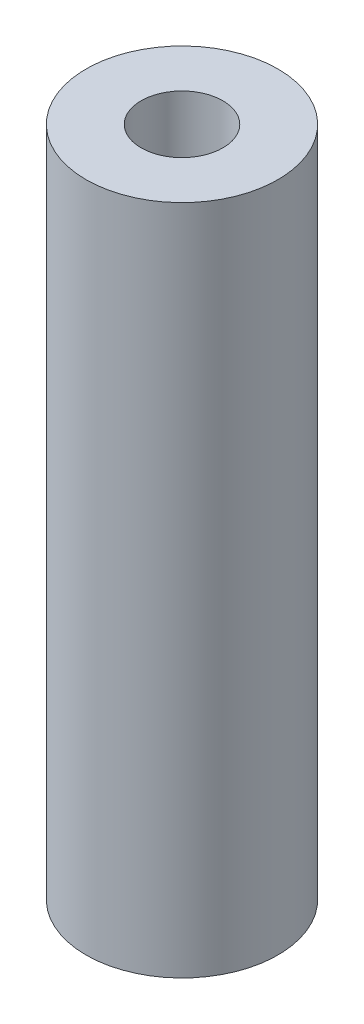
ISO-10303-21;
HEADER;
FILE_DESCRIPTION(('STEP AP214'),'2;1');
FILE_NAME('part.step','',(''),(''),'','','');
FILE_SCHEMA(('AUTOMOTIVE_DESIGN { 1 0 10303 214 1 1 1 1 }'));
ENDSEC;
DATA;
#1=APPLICATION_CONTEXT('core data for automotive mechanical design processes');
#2=APPLICATION_PROTOCOL_DEFINITION('international standard','automotive_design',2000,#1);
#3=PRODUCT_CONTEXT('',#1,'mechanical');
#4=PRODUCT('Part','Part','',(#3));
#5=PRODUCT_RELATED_PRODUCT_CATEGORY('part','',(#4));
#6=PRODUCT_DEFINITION_FORMATION('','',#4);
#7=PRODUCT_DEFINITION_CONTEXT('part definition',#1,'design');
#8=PRODUCT_DEFINITION('design','',#6,#7);
#9=PRODUCT_DEFINITION_SHAPE('','',#8);
#10=(LENGTH_UNIT() NAMED_UNIT(*) SI_UNIT(.MILLI.,.METRE.));
#11=(NAMED_UNIT(*) PLANE_ANGLE_UNIT() SI_UNIT($,.RADIAN.));
#12=(NAMED_UNIT(*) SI_UNIT($,.STERADIAN.) SOLID_ANGLE_UNIT());
#13=UNCERTAINTY_MEASURE_WITH_UNIT(LENGTH_MEASURE(1.E-05),#10,'distance_accuracy_value','');
#14=(GEOMETRIC_REPRESENTATION_CONTEXT(3) GLOBAL_UNCERTAINTY_ASSIGNED_CONTEXT((#13)) GLOBAL_UNIT_ASSIGNED_CONTEXT((#10,
#11,#12)) REPRESENTATION_CONTEXT('',''));
#15=CARTESIAN_POINT('',(0.,0.,0.));
#16=DIRECTION('',(0.,0.,1.));
#17=DIRECTION('',(1.,0.,0.));
#18=AXIS2_PLACEMENT_3D('',#15,#16,#17);
#19=CARTESIAN_POINT('',(0.,22.225,0.));
#20=DIRECTION('',(0.,-1.,0.));
#21=DIRECTION('',(0.,0.,-1.));
#22=AXIS2_PLACEMENT_3D('',#19,#20,#21);
#23=CYLINDRICAL_SURFACE('',#22,3.175);
#24=CARTESIAN_POINT('',(0.,22.225,0.));
#25=DIRECTION('',(0.,1.,0.));
#26=DIRECTION('',(0.,0.,1.));
#27=AXIS2_PLACEMENT_3D('',#24,#25,#26);
#28=CIRCLE('',#27,3.175);
#29=CARTESIAN_POINT('',(0.,22.225,3.175));
#30=VERTEX_POINT('',#29);
#31=EDGE_CURVE('E10',#30,#30,#28,.T.);
#32=ORIENTED_EDGE('',*,*,#31,.F.);
#33=EDGE_LOOP('',(#32));
#34=FACE_BOUND('',#33,.T.);
#35=CARTESIAN_POINT('',(0.,0.,0.));
#36=DIRECTION('',(0.,1.,0.));
#37=DIRECTION('',(0.,0.,1.));
#38=AXIS2_PLACEMENT_3D('',#35,#36,#37);
#39=CIRCLE('',#38,3.175);
#40=CARTESIAN_POINT('',(0.,0.,3.175));
#41=VERTEX_POINT('',#40);
#42=EDGE_CURVE('E34',#41,#41,#39,.T.);
#43=ORIENTED_EDGE('',*,*,#42,.T.);
#44=EDGE_LOOP('',(#43));
#45=FACE_BOUND('',#44,.T.);
#46=ADVANCED_FACE('F31',(#34,#45),#23,.T.);
#47=CARTESIAN_POINT('',(0.,22.225,0.));
#48=DIRECTION('',(0.,1.,0.));
#49=DIRECTION('',(0.,0.,1.));
#50=AXIS2_PLACEMENT_3D('',#47,#48,#49);
#51=PLANE('',#50);
#52=CARTESIAN_POINT('',(0.,22.225,0.));
#53=DIRECTION('',(0.,1.,0.));
#54=DIRECTION('',(0.,0.,1.));
#55=AXIS2_PLACEMENT_3D('',#52,#53,#54);
#56=CIRCLE('',#55,1.35254999999999);
#57=CARTESIAN_POINT('',(0.,22.225,1.35254999999999));
#58=VERTEX_POINT('',#57);
#59=EDGE_CURVE('E45',#58,#58,#56,.T.);
#60=ORIENTED_EDGE('',*,*,#59,.F.);
#61=EDGE_LOOP('',(#60));
#62=FACE_BOUND('',#61,.T.);
#63=ORIENTED_EDGE('',*,*,#31,.T.);
#64=EDGE_LOOP('',(#63));
#65=FACE_BOUND('',#64,.T.);
#66=ADVANCED_FACE('F51',(#62,#65),#51,.T.);
#67=CARTESIAN_POINT('',(0.,0.,0.));
#68=DIRECTION('',(0.,1.,0.));
#69=DIRECTION('',(0.,0.,1.));
#70=AXIS2_PLACEMENT_3D('',#67,#68,#69);
#71=PLANE('',#70);
#72=CARTESIAN_POINT('',(0.,0.,0.));
#73=DIRECTION('',(0.,1.,0.));
#74=DIRECTION('',(0.,0.,1.));
#75=AXIS2_PLACEMENT_3D('',#72,#73,#74);
#76=CIRCLE('',#75,1.35254999999999);
#77=CARTESIAN_POINT('',(0.,0.,1.35254999999999));
#78=VERTEX_POINT('',#77);
#79=EDGE_CURVE('E41',#78,#78,#76,.T.);
#80=ORIENTED_EDGE('',*,*,#79,.T.);
#81=EDGE_LOOP('',(#80));
#82=FACE_BOUND('',#81,.T.);
#83=ORIENTED_EDGE('',*,*,#42,.F.);
#84=EDGE_LOOP('',(#83));
#85=FACE_BOUND('',#84,.T.);
#86=ADVANCED_FACE('F53',(#82,#85),#71,.F.);
#87=CARTESIAN_POINT('',(0.,22.225,0.));
#88=DIRECTION('',(0.,1.,0.));
#89=DIRECTION('',(0.,0.,1.));
#90=AXIS2_PLACEMENT_3D('',#87,#88,#89);
#91=CYLINDRICAL_SURFACE('',#90,1.35254999999999);
#92=ORIENTED_EDGE('',*,*,#79,.F.);
#93=EDGE_LOOP('',(#92));
#94=FACE_BOUND('',#93,.T.);
#95=ORIENTED_EDGE('',*,*,#59,.T.);
#96=EDGE_LOOP('',(#95));
#97=FACE_BOUND('',#96,.T.);
#98=ADVANCED_FACE('F49',(#94,#97),#91,.F.);
#99=CLOSED_SHELL('',(#46,#66,#86,#98));
#100=MANIFOLD_SOLID_BREP('B2',#99);
#101=ADVANCED_BREP_SHAPE_REPRESENTATION('',(#18,#100),#14);
#102=SHAPE_DEFINITION_REPRESENTATION(#9,#101);
ENDSEC;
END-ISO-10303-21;
